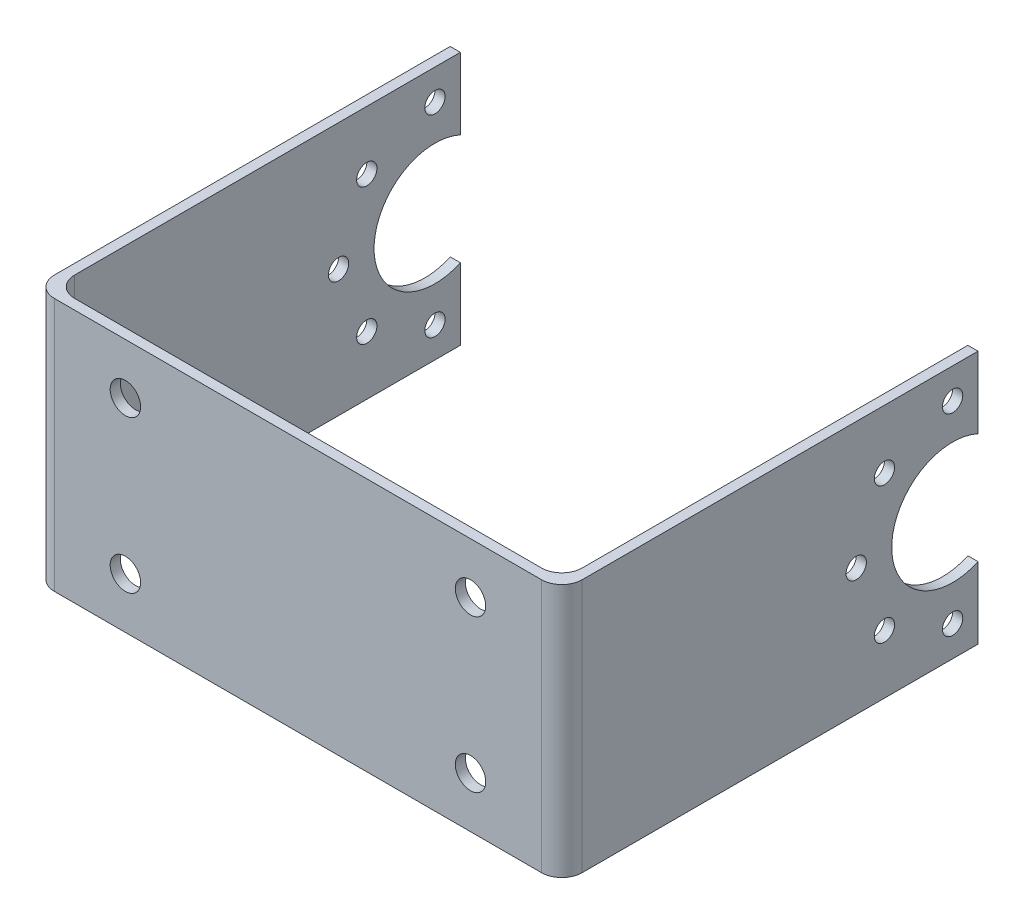
ISO-10303-21;
HEADER;
FILE_DESCRIPTION(('STEP AP214'),'2;1');
FILE_NAME('part.step','',(''),(''),'','','');
FILE_SCHEMA(('AUTOMOTIVE_DESIGN { 1 0 10303 214 1 1 1 1 }'));
ENDSEC;
DATA;
#1=APPLICATION_CONTEXT('core data for automotive mechanical design processes');
#2=APPLICATION_PROTOCOL_DEFINITION('international standard','automotive_design',2000,#1);
#3=PRODUCT_CONTEXT('',#1,'mechanical');
#4=PRODUCT('Part','Part','',(#3));
#5=PRODUCT_RELATED_PRODUCT_CATEGORY('part','',(#4));
#6=PRODUCT_DEFINITION_FORMATION('','',#4);
#7=PRODUCT_DEFINITION_CONTEXT('part definition',#1,'design');
#8=PRODUCT_DEFINITION('design','',#6,#7);
#9=PRODUCT_DEFINITION_SHAPE('','',#8);
#10=(LENGTH_UNIT() NAMED_UNIT(*) SI_UNIT(.MILLI.,.METRE.));
#11=(NAMED_UNIT(*) PLANE_ANGLE_UNIT() SI_UNIT($,.RADIAN.));
#12=(NAMED_UNIT(*) SI_UNIT($,.STERADIAN.) SOLID_ANGLE_UNIT());
#13=UNCERTAINTY_MEASURE_WITH_UNIT(LENGTH_MEASURE(1.E-05),#10,'distance_accuracy_value','');
#14=(GEOMETRIC_REPRESENTATION_CONTEXT(3) GLOBAL_UNCERTAINTY_ASSIGNED_CONTEXT((#13)) GLOBAL_UNIT_ASSIGNED_CONTEXT((#10,
#11,#12)) REPRESENTATION_CONTEXT('',''));
#15=CARTESIAN_POINT('',(0.,0.,0.));
#16=DIRECTION('',(0.,0.,1.));
#17=DIRECTION('',(1.,0.,0.));
#18=AXIS2_PLACEMENT_3D('',#15,#16,#17);
#19=CARTESIAN_POINT('',(29.5000000000001,25.,-40.5));
#20=DIRECTION('',(0.,0.,1.));
#21=DIRECTION('',(1.,0.,0.));
#22=AXIS2_PLACEMENT_3D('',#19,#20,#21);
#23=PLANE('',#22);
#24=DIRECTION('',(0.,-1.,0.));
#25=VECTOR('',#24,1.);
#26=CARTESIAN_POINT('',(28.5000000000001,25.,-40.5));
#27=LINE('',#26,#25);
#28=CARTESIAN_POINT('',(28.5000000000001,7.04564394268215,-40.5));
#29=VERTEX_POINT('',#28);
#30=CARTESIAN_POINT('',(28.5000000000001,0.,-40.5));
#31=VERTEX_POINT('',#30);
#32=EDGE_CURVE('E216',#29,#31,#27,.T.);
#33=ORIENTED_EDGE('',*,*,#32,.F.);
#34=DIRECTION('',(1.,0.,0.));
#35=VECTOR('',#34,1.);
#36=CARTESIAN_POINT('',(-22.4999999999999,7.04564394268215,-40.5));
#37=LINE('',#36,#35);
#38=CARTESIAN_POINT('',(29.5000000000001,7.04564394268215,-40.5));
#39=VERTEX_POINT('',#38);
#40=EDGE_CURVE('E200',#29,#39,#37,.T.);
#41=ORIENTED_EDGE('',*,*,#40,.T.);
#42=DIRECTION('',(0.,-1.,0.));
#43=VECTOR('',#42,1.);
#44=CARTESIAN_POINT('',(29.5000000000001,25.,-40.5));
#45=LINE('',#44,#43);
#46=CARTESIAN_POINT('',(29.5000000000001,0.,-40.5));
#47=VERTEX_POINT('',#46);
#48=EDGE_CURVE('E220',#39,#47,#45,.T.);
#49=ORIENTED_EDGE('',*,*,#48,.T.);
#50=DIRECTION('',(-1.,0.,0.));
#51=VECTOR('',#50,1.);
#52=CARTESIAN_POINT('',(29.5000000000001,0.,-40.5));
#53=LINE('',#52,#51);
#54=EDGE_CURVE('E272',#47,#31,#53,.T.);
#55=ORIENTED_EDGE('',*,*,#54,.T.);
#56=EDGE_LOOP('',(#33,#41,#49,#55));
#57=FACE_BOUND('',#56,.T.);
#58=ADVANCED_FACE('F65',(#57),#23,.F.);
#59=CARTESIAN_POINT('',(-22.4999999999999,25.,-40.5));
#60=DIRECTION('',(0.,0.,1.));
#61=DIRECTION('',(1.,0.,0.));
#62=AXIS2_PLACEMENT_3D('',#59,#60,#61);
#63=PLANE('',#62);
#64=DIRECTION('',(0.,-1.,0.));
#65=VECTOR('',#64,1.);
#66=CARTESIAN_POINT('',(-22.4999999999999,25.,-40.5));
#67=LINE('',#66,#65);
#68=CARTESIAN_POINT('',(-22.4999999999999,7.04564394268215,-40.5));
#69=VERTEX_POINT('',#68);
#70=CARTESIAN_POINT('',(-22.4999999999999,0.,-40.5));
#71=VERTEX_POINT('',#70);
#72=EDGE_CURVE('E207',#69,#71,#67,.T.);
#73=ORIENTED_EDGE('',*,*,#72,.F.);
#74=CARTESIAN_POINT('',(-21.4999999999999,7.04564394268215,-40.5));
#75=VERTEX_POINT('',#74);
#76=EDGE_CURVE('E184',#69,#75,#37,.T.);
#77=ORIENTED_EDGE('',*,*,#76,.T.);
#78=DIRECTION('',(0.,-1.,0.));
#79=VECTOR('',#78,1.);
#80=CARTESIAN_POINT('',(-21.4999999999999,25.,-40.5));
#81=LINE('',#80,#79);
#82=CARTESIAN_POINT('',(-21.4999999999999,0.,-40.5));
#83=VERTEX_POINT('',#82);
#84=EDGE_CURVE('E206',#75,#83,#81,.T.);
#85=ORIENTED_EDGE('',*,*,#84,.T.);
#86=DIRECTION('',(-1.,0.,0.));
#87=VECTOR('',#86,1.);
#88=CARTESIAN_POINT('',(-22.4999999999999,0.,-40.5));
#89=LINE('',#88,#87);
#90=EDGE_CURVE('E298',#83,#71,#89,.T.);
#91=ORIENTED_EDGE('',*,*,#90,.T.);
#92=EDGE_LOOP('',(#73,#77,#85,#91));
#93=FACE_BOUND('',#92,.T.);
#94=ADVANCED_FACE('F450',(#93),#63,.F.);
#95=CARTESIAN_POINT('',(29.5000000000001,25.,-0.500000000000002));
#96=DIRECTION('',(-1.,0.,0.));
#97=DIRECTION('',(0.,0.,1.));
#98=AXIS2_PLACEMENT_3D('',#95,#96,#97);
#99=PLANE('',#98);
#100=CARTESIAN_POINT('',(29.5000000000001,5.7824855787278,-31.2824855787278));
#101=DIRECTION('',(1.,0.,0.));
#102=DIRECTION('',(0.,0.,-1.));
#103=AXIS2_PLACEMENT_3D('',#100,#101,#102);
#104=CIRCLE('',#103,0.999999999999998);
#105=CARTESIAN_POINT('',(29.5000000000001,5.7824855787278,-32.2824855787278));
#106=VERTEX_POINT('',#105);
#107=EDGE_CURVE('E370',#106,#106,#104,.T.);
#108=ORIENTED_EDGE('',*,*,#107,.F.);
#109=EDGE_LOOP('',(#108));
#110=FACE_BOUND('',#109,.T.);
#111=CARTESIAN_POINT('',(29.5000000000001,3.,-38.));
#112=DIRECTION('',(1.,0.,0.));
#113=DIRECTION('',(0.,0.,-1.));
#114=AXIS2_PLACEMENT_3D('',#111,#112,#113);
#115=CIRCLE('',#114,0.999999999999998);
#116=CARTESIAN_POINT('',(29.5000000000001,3.,-39.));
#117=VERTEX_POINT('',#116);
#118=EDGE_CURVE('E358',#117,#117,#115,.T.);
#119=ORIENTED_EDGE('',*,*,#118,.F.);
#120=EDGE_LOOP('',(#119));
#121=FACE_BOUND('',#120,.T.);
#122=CARTESIAN_POINT('',(29.5000000000001,12.5,-28.5));
#123=DIRECTION('',(1.,0.,0.));
#124=DIRECTION('',(0.,0.,-1.));
#125=AXIS2_PLACEMENT_3D('',#122,#123,#124);
#126=CIRCLE('',#125,1.);
#127=CARTESIAN_POINT('',(29.5000000000001,12.5,-29.5));
#128=VERTEX_POINT('',#127);
#129=EDGE_CURVE('E346',#128,#128,#126,.T.);
#130=ORIENTED_EDGE('',*,*,#129,.F.);
#131=EDGE_LOOP('',(#130));
#132=FACE_BOUND('',#131,.T.);
#133=CARTESIAN_POINT('',(29.5000000000001,19.2175144212722,-31.2824855787278));
#134=DIRECTION('',(1.,0.,0.));
#135=DIRECTION('',(0.,0.,-1.));
#136=AXIS2_PLACEMENT_3D('',#133,#134,#135);
#137=CIRCLE('',#136,1.00000000000001);
#138=CARTESIAN_POINT('',(29.5000000000001,19.2175144212722,-32.2824855787278));
#139=VERTEX_POINT('',#138);
#140=EDGE_CURVE('E334',#139,#139,#137,.T.);
#141=ORIENTED_EDGE('',*,*,#140,.F.);
#142=EDGE_LOOP('',(#141));
#143=FACE_BOUND('',#142,.T.);
#144=CARTESIAN_POINT('',(29.5000000000001,22.,-38.));
#145=DIRECTION('',(1.,0.,0.));
#146=DIRECTION('',(0.,0.,-1.));
#147=AXIS2_PLACEMENT_3D('',#144,#145,#146);
#148=CIRCLE('',#147,0.999999999999998);
#149=CARTESIAN_POINT('',(29.5000000000001,22.,-39.));
#150=VERTEX_POINT('',#149);
#151=EDGE_CURVE('E322',#150,#150,#148,.T.);
#152=ORIENTED_EDGE('',*,*,#151,.F.);
#153=EDGE_LOOP('',(#152));
#154=FACE_BOUND('',#153,.T.);
#155=DIRECTION('',(0.,0.,-1.));
#156=VECTOR('',#155,1.);
#157=CARTESIAN_POINT('',(29.5000000000001,25.,-0.500000000000002));
#158=LINE('',#157,#156);
#159=CARTESIAN_POINT('',(29.5000000000001,25.,-1.5));
#160=VERTEX_POINT('',#159);
#161=CARTESIAN_POINT('',(29.5000000000001,25.,-40.5));
#162=VERTEX_POINT('',#161);
#163=EDGE_CURVE('E304',#160,#162,#158,.T.);
#164=ORIENTED_EDGE('',*,*,#163,.F.);
#165=DIRECTION('',(0.,-1.,0.));
#166=VECTOR('',#165,1.);
#167=CARTESIAN_POINT('',(29.5000000000001,25.,-1.5));
#168=LINE('',#167,#166);
#169=CARTESIAN_POINT('',(29.5000000000001,0.,-1.5));
#170=VERTEX_POINT('',#169);
#171=EDGE_CURVE('E246',#160,#170,#168,.T.);
#172=ORIENTED_EDGE('',*,*,#171,.T.);
#173=DIRECTION('',(0.,0.,-1.));
#174=VECTOR('',#173,1.);
#175=CARTESIAN_POINT('',(29.5000000000001,0.,-0.500000000000002));
#176=LINE('',#175,#174);
#177=EDGE_CURVE('E291',#170,#47,#176,.T.);
#178=ORIENTED_EDGE('',*,*,#177,.T.);
#179=ORIENTED_EDGE('',*,*,#48,.F.);
#180=CARTESIAN_POINT('',(29.5000000000001,12.5,-38.));
#181=DIRECTION('',(1.,0.,0.));
#182=DIRECTION('',(0.,0.,-1.));
#183=AXIS2_PLACEMENT_3D('',#180,#181,#182);
#184=CIRCLE('',#183,5.99999999999999);
#185=CARTESIAN_POINT('',(29.5000000000001,17.9543560573178,-40.5));
#186=VERTEX_POINT('',#185);
#187=EDGE_CURVE('E189',#186,#39,#184,.T.);
#188=ORIENTED_EDGE('',*,*,#187,.F.);
#189=EDGE_CURVE('E221',#162,#186,#45,.T.);
#190=ORIENTED_EDGE('',*,*,#189,.F.);
#191=EDGE_LOOP('',(#164,#172,#178,#179,#188,#190));
#192=FACE_BOUND('',#191,.T.);
#193=ADVANCED_FACE('F425',(#110,#121,#132,#143,#154,#192),#99,.F.);
#194=ORIENTED_EDGE('',*,*,#189,.T.);
#195=DIRECTION('',(1.,0.,0.));
#196=VECTOR('',#195,1.);
#197=CARTESIAN_POINT('',(-22.4999999999999,17.9543560573178,-40.5));
#198=LINE('',#197,#196);
#199=CARTESIAN_POINT('',(28.5,17.9543560573178,-40.5));
#200=VERTEX_POINT('',#199);
#201=EDGE_CURVE('E188',#200,#186,#198,.T.);
#202=ORIENTED_EDGE('',*,*,#201,.F.);
#203=CARTESIAN_POINT('',(28.5000000000001,25.,-40.5));
#204=VERTEX_POINT('',#203);
#205=EDGE_CURVE('E217',#204,#200,#27,.T.);
#206=ORIENTED_EDGE('',*,*,#205,.F.);
#207=DIRECTION('',(-1.,0.,0.));
#208=VECTOR('',#207,1.);
#209=CARTESIAN_POINT('',(29.5000000000001,25.,-40.5));
#210=LINE('',#209,#208);
#211=EDGE_CURVE('E283',#162,#204,#210,.T.);
#212=ORIENTED_EDGE('',*,*,#211,.F.);
#213=EDGE_LOOP('',(#194,#202,#206,#212));
#214=FACE_BOUND('',#213,.T.);
#215=ADVANCED_FACE('F433',(#214),#23,.F.);
#216=CARTESIAN_POINT('',(28.5000000000001,25.,-0.499999999999996));
#217=DIRECTION('',(1.,0.,0.));
#218=DIRECTION('',(0.,0.,-1.));
#219=AXIS2_PLACEMENT_3D('',#216,#217,#218);
#220=PLANE('',#219);
#221=CARTESIAN_POINT('',(28.5000000000001,5.7824855787278,-31.2824855787278));
#222=DIRECTION('',(1.,0.,0.));
#223=DIRECTION('',(0.,0.,-1.));
#224=AXIS2_PLACEMENT_3D('',#221,#222,#223);
#225=CIRCLE('',#224,0.999999999999998);
#226=CARTESIAN_POINT('',(28.5000000000001,5.7824855787278,-32.2824855787278));
#227=VERTEX_POINT('',#226);
#228=EDGE_CURVE('E362',#227,#227,#225,.T.);
#229=ORIENTED_EDGE('',*,*,#228,.T.);
#230=EDGE_LOOP('',(#229));
#231=FACE_BOUND('',#230,.T.);
#232=CARTESIAN_POINT('',(28.5000000000001,3.,-38.));
#233=DIRECTION('',(1.,0.,0.));
#234=DIRECTION('',(0.,0.,-1.));
#235=AXIS2_PLACEMENT_3D('',#232,#233,#234);
#236=CIRCLE('',#235,0.999999999999998);
#237=CARTESIAN_POINT('',(28.5000000000001,3.,-39.));
#238=VERTEX_POINT('',#237);
#239=EDGE_CURVE('E350',#238,#238,#236,.T.);
#240=ORIENTED_EDGE('',*,*,#239,.T.);
#241=EDGE_LOOP('',(#240));
#242=FACE_BOUND('',#241,.T.);
#243=CARTESIAN_POINT('',(28.5000000000001,12.5,-28.5));
#244=DIRECTION('',(1.,0.,0.));
#245=DIRECTION('',(0.,0.,-1.));
#246=AXIS2_PLACEMENT_3D('',#243,#244,#245);
#247=CIRCLE('',#246,1.);
#248=CARTESIAN_POINT('',(28.5000000000001,12.5,-29.5));
#249=VERTEX_POINT('',#248);
#250=EDGE_CURVE('E338',#249,#249,#247,.T.);
#251=ORIENTED_EDGE('',*,*,#250,.T.);
#252=EDGE_LOOP('',(#251));
#253=FACE_BOUND('',#252,.T.);
#254=CARTESIAN_POINT('',(28.5000000000001,19.2175144212722,-31.2824855787278));
#255=DIRECTION('',(1.,0.,0.));
#256=DIRECTION('',(0.,0.,-1.));
#257=AXIS2_PLACEMENT_3D('',#254,#255,#256);
#258=CIRCLE('',#257,1.00000000000001);
#259=CARTESIAN_POINT('',(28.5000000000001,19.2175144212722,-32.2824855787278));
#260=VERTEX_POINT('',#259);
#261=EDGE_CURVE('E326',#260,#260,#258,.T.);
#262=ORIENTED_EDGE('',*,*,#261,.T.);
#263=EDGE_LOOP('',(#262));
#264=FACE_BOUND('',#263,.T.);
#265=CARTESIAN_POINT('',(28.5000000000001,22.,-38.));
#266=DIRECTION('',(1.,0.,0.));
#267=DIRECTION('',(0.,0.,-1.));
#268=AXIS2_PLACEMENT_3D('',#265,#266,#267);
#269=CIRCLE('',#268,0.999999999999998);
#270=CARTESIAN_POINT('',(28.5000000000001,22.,-39.));
#271=VERTEX_POINT('',#270);
#272=EDGE_CURVE('E315',#271,#271,#269,.T.);
#273=ORIENTED_EDGE('',*,*,#272,.T.);
#274=EDGE_LOOP('',(#273));
#275=FACE_BOUND('',#274,.T.);
#276=DIRECTION('',(0.,0.,1.));
#277=VECTOR('',#276,1.);
#278=CARTESIAN_POINT('',(28.5000000000001,0.,-0.499999999999996));
#279=LINE('',#278,#277);
#280=CARTESIAN_POINT('',(28.5000000000001,0.,-2.5));
#281=VERTEX_POINT('',#280);
#282=EDGE_CURVE('E260',#31,#281,#279,.T.);
#283=ORIENTED_EDGE('',*,*,#282,.T.);
#284=DIRECTION('',(0.,-1.,0.));
#285=VECTOR('',#284,1.);
#286=CARTESIAN_POINT('',(28.5000000000001,25.,-2.5));
#287=LINE('',#286,#285);
#288=CARTESIAN_POINT('',(28.5000000000001,25.,-2.5));
#289=VERTEX_POINT('',#288);
#290=EDGE_CURVE('E249',#281,#289,#287,.F.);
#291=ORIENTED_EDGE('',*,*,#290,.T.);
#292=DIRECTION('',(0.,0.,1.));
#293=VECTOR('',#292,1.);
#294=CARTESIAN_POINT('',(28.5000000000001,25.,-0.499999999999996));
#295=LINE('',#294,#293);
#296=EDGE_CURVE('E277',#204,#289,#295,.T.);
#297=ORIENTED_EDGE('',*,*,#296,.F.);
#298=ORIENTED_EDGE('',*,*,#205,.T.);
#299=CARTESIAN_POINT('',(28.5000000000001,12.5,-38.));
#300=DIRECTION('',(1.,0.,0.));
#301=DIRECTION('',(0.,0.,-1.));
#302=AXIS2_PLACEMENT_3D('',#299,#300,#301);
#303=CIRCLE('',#302,5.99999999999999);
#304=EDGE_CURVE('E293',#200,#29,#303,.T.);
#305=ORIENTED_EDGE('',*,*,#304,.T.);
#306=ORIENTED_EDGE('',*,*,#32,.T.);
#307=EDGE_LOOP('',(#283,#291,#297,#298,#305,#306));
#308=FACE_BOUND('',#307,.T.);
#309=ADVANCED_FACE('F266',(#231,#242,#253,#264,#275,#308),#220,.F.);
#310=CARTESIAN_POINT('',(-21.4999999999999,25.,-0.499999999999996));
#311=DIRECTION('',(0.,0.,1.));
#312=DIRECTION('',(1.,0.,0.));
#313=AXIS2_PLACEMENT_3D('',#310,#311,#312);
#314=PLANE('',#313);
#315=CARTESIAN_POINT('',(20.5000000000001,5.,-0.499999999999994));
#316=DIRECTION('',(0.,0.,1.));
#317=DIRECTION('',(1.,0.,0.));
#318=AXIS2_PLACEMENT_3D('',#315,#316,#317);
#319=CIRCLE('',#318,1.5);
#320=CARTESIAN_POINT('',(22.0000000000001,5.,-0.499999999999994));
#321=VERTEX_POINT('',#320);
#322=EDGE_CURVE('E394',#321,#321,#319,.T.);
#323=ORIENTED_EDGE('',*,*,#322,.T.);
#324=EDGE_LOOP('',(#323));
#325=FACE_BOUND('',#324,.T.);
#326=CARTESIAN_POINT('',(20.5,20.,-0.499999999999994));
#327=DIRECTION('',(0.,0.,1.));
#328=DIRECTION('',(1.,0.,0.));
#329=AXIS2_PLACEMENT_3D('',#326,#327,#328);
#330=CIRCLE('',#329,1.5);
#331=CARTESIAN_POINT('',(22.,20.,-0.499999999999994));
#332=VERTEX_POINT('',#331);
#333=EDGE_CURVE('E388',#332,#332,#330,.T.);
#334=ORIENTED_EDGE('',*,*,#333,.T.);
#335=EDGE_LOOP('',(#334));
#336=FACE_BOUND('',#335,.T.);
#337=CARTESIAN_POINT('',(-13.5,5.,-0.499999999999994));
#338=DIRECTION('',(0.,0.,1.));
#339=DIRECTION('',(1.,0.,0.));
#340=AXIS2_PLACEMENT_3D('',#337,#338,#339);
#341=CIRCLE('',#340,1.5);
#342=CARTESIAN_POINT('',(-11.9999999999999,5.,-0.499999999999994));
#343=VERTEX_POINT('',#342);
#344=EDGE_CURVE('E382',#343,#343,#341,.T.);
#345=ORIENTED_EDGE('',*,*,#344,.T.);
#346=EDGE_LOOP('',(#345));
#347=FACE_BOUND('',#346,.T.);
#348=CARTESIAN_POINT('',(-13.5,20.,-0.499999999999994));
#349=DIRECTION('',(0.,0.,1.));
#350=DIRECTION('',(1.,0.,0.));
#351=AXIS2_PLACEMENT_3D('',#348,#349,#350);
#352=CIRCLE('',#351,1.5);
#353=CARTESIAN_POINT('',(-12.,20.,-0.499999999999994));
#354=VERTEX_POINT('',#353);
#355=EDGE_CURVE('E374',#354,#354,#352,.T.);
#356=ORIENTED_EDGE('',*,*,#355,.T.);
#357=EDGE_LOOP('',(#356));
#358=FACE_BOUND('',#357,.T.);
#359=DIRECTION('',(-1.,0.,0.));
#360=VECTOR('',#359,1.);
#361=CARTESIAN_POINT('',(-21.4999999999999,0.,-0.499999999999996));
#362=LINE('',#361,#360);
#363=CARTESIAN_POINT('',(26.5,0.,-0.499999999999996));
#364=VERTEX_POINT('',#363);
#365=CARTESIAN_POINT('',(-19.4999999999999,0.,-0.499999999999996));
#366=VERTEX_POINT('',#365);
#367=EDGE_CURVE('E261',#364,#366,#362,.T.);
#368=ORIENTED_EDGE('',*,*,#367,.T.);
#369=DIRECTION('',(0.,-1.,0.));
#370=VECTOR('',#369,1.);
#371=CARTESIAN_POINT('',(-19.4999999999999,25.,-0.499999999999996));
#372=LINE('',#371,#370);
#373=CARTESIAN_POINT('',(-19.4999999999999,25.,-0.499999999999996));
#374=VERTEX_POINT('',#373);
#375=EDGE_CURVE('E88',#366,#374,#372,.F.);
#376=ORIENTED_EDGE('',*,*,#375,.T.);
#377=DIRECTION('',(-1.,0.,0.));
#378=VECTOR('',#377,1.);
#379=CARTESIAN_POINT('',(-21.4999999999999,25.,-0.499999999999996));
#380=LINE('',#379,#378);
#381=CARTESIAN_POINT('',(26.5,25.,-0.499999999999996));
#382=VERTEX_POINT('',#381);
#383=EDGE_CURVE('E276',#382,#374,#380,.T.);
#384=ORIENTED_EDGE('',*,*,#383,.F.);
#385=DIRECTION('',(0.,-1.,0.));
#386=VECTOR('',#385,1.);
#387=CARTESIAN_POINT('',(26.5,0.,-0.499999999999996));
#388=LINE('',#387,#386);
#389=EDGE_CURVE('E242',#382,#364,#388,.T.);
#390=ORIENTED_EDGE('',*,*,#389,.T.);
#391=EDGE_LOOP('',(#368,#376,#384,#390));
#392=FACE_BOUND('',#391,.T.);
#393=ADVANCED_FACE('F278',(#325,#336,#347,#358,#392),#314,.F.);
#394=CARTESIAN_POINT('',(-21.4999999999999,25.,-0.499999999999996));
#395=DIRECTION('',(-1.,0.,0.));
#396=DIRECTION('',(0.,0.,1.));
#397=AXIS2_PLACEMENT_3D('',#394,#395,#396);
#398=PLANE('',#397);
#399=CARTESIAN_POINT('',(-21.4999999999999,5.7824855787278,-31.2824855787278));
#400=DIRECTION('',(-1.,0.,0.));
#401=DIRECTION('',(0.,0.,1.));
#402=AXIS2_PLACEMENT_3D('',#399,#400,#401);
#403=CIRCLE('',#402,0.999999999999998);
#404=CARTESIAN_POINT('',(-21.4999999999999,5.7824855787278,-30.2824855787278));
#405=VERTEX_POINT('',#404);
#406=EDGE_CURVE('E367',#405,#405,#403,.T.);
#407=ORIENTED_EDGE('',*,*,#406,.T.);
#408=EDGE_LOOP('',(#407));
#409=FACE_BOUND('',#408,.T.);
#410=CARTESIAN_POINT('',(-21.4999999999999,3.,-38.));
#411=DIRECTION('',(-1.,0.,0.));
#412=DIRECTION('',(0.,0.,1.));
#413=AXIS2_PLACEMENT_3D('',#410,#411,#412);
#414=CIRCLE('',#413,0.999999999999998);
#415=CARTESIAN_POINT('',(-21.4999999999999,3.,-37.));
#416=VERTEX_POINT('',#415);
#417=EDGE_CURVE('E355',#416,#416,#414,.T.);
#418=ORIENTED_EDGE('',*,*,#417,.T.);
#419=EDGE_LOOP('',(#418));
#420=FACE_BOUND('',#419,.T.);
#421=CARTESIAN_POINT('',(-21.4999999999999,12.5,-28.5));
#422=DIRECTION('',(-1.,0.,0.));
#423=DIRECTION('',(0.,0.,1.));
#424=AXIS2_PLACEMENT_3D('',#421,#422,#423);
#425=CIRCLE('',#424,1.);
#426=CARTESIAN_POINT('',(-21.4999999999999,12.5,-27.5));
#427=VERTEX_POINT('',#426);
#428=EDGE_CURVE('E343',#427,#427,#425,.T.);
#429=ORIENTED_EDGE('',*,*,#428,.T.);
#430=EDGE_LOOP('',(#429));
#431=FACE_BOUND('',#430,.T.);
#432=CARTESIAN_POINT('',(-21.4999999999999,19.2175144212722,-31.2824855787278));
#433=DIRECTION('',(-1.,0.,0.));
#434=DIRECTION('',(0.,0.,1.));
#435=AXIS2_PLACEMENT_3D('',#432,#433,#434);
#436=CIRCLE('',#435,1.00000000000001);
#437=CARTESIAN_POINT('',(-21.4999999999999,19.2175144212722,-30.2824855787278));
#438=VERTEX_POINT('',#437);
#439=EDGE_CURVE('E331',#438,#438,#436,.T.);
#440=ORIENTED_EDGE('',*,*,#439,.T.);
#441=EDGE_LOOP('',(#440));
#442=FACE_BOUND('',#441,.T.);
#443=CARTESIAN_POINT('',(-21.4999999999999,22.,-38.));
#444=DIRECTION('',(-1.,0.,0.));
#445=DIRECTION('',(0.,0.,1.));
#446=AXIS2_PLACEMENT_3D('',#443,#444,#445);
#447=CIRCLE('',#446,0.999999999999998);
#448=CARTESIAN_POINT('',(-21.4999999999999,22.,-37.));
#449=VERTEX_POINT('',#448);
#450=EDGE_CURVE('E319',#449,#449,#447,.T.);
#451=ORIENTED_EDGE('',*,*,#450,.T.);
#452=EDGE_LOOP('',(#451));
#453=FACE_BOUND('',#452,.T.);
#454=DIRECTION('',(0.,0.,-1.));
#455=VECTOR('',#454,1.);
#456=CARTESIAN_POINT('',(-21.4999999999999,25.,-0.499999999999996));
#457=LINE('',#456,#455);
#458=CARTESIAN_POINT('',(-21.4999999999999,25.,-2.5));
#459=VERTEX_POINT('',#458);
#460=CARTESIAN_POINT('',(-21.4999999999999,25.,-40.5));
#461=VERTEX_POINT('',#460);
#462=EDGE_CURVE('E279',#459,#461,#457,.T.);
#463=ORIENTED_EDGE('',*,*,#462,.F.);
#464=DIRECTION('',(0.,-1.,0.));
#465=VECTOR('',#464,1.);
#466=CARTESIAN_POINT('',(-21.4999999999999,0.,-2.5));
#467=LINE('',#466,#465);
#468=CARTESIAN_POINT('',(-21.4999999999999,0.,-2.5));
#469=VERTEX_POINT('',#468);
#470=EDGE_CURVE('E239',#459,#469,#467,.T.);
#471=ORIENTED_EDGE('',*,*,#470,.T.);
#472=DIRECTION('',(0.,0.,-1.));
#473=VECTOR('',#472,1.);
#474=CARTESIAN_POINT('',(-21.4999999999999,0.,-0.499999999999996));
#475=LINE('',#474,#473);
#476=EDGE_CURVE('E296',#469,#83,#475,.T.);
#477=ORIENTED_EDGE('',*,*,#476,.T.);
#478=ORIENTED_EDGE('',*,*,#84,.F.);
#479=CARTESIAN_POINT('',(-21.4999999999999,12.5,-38.));
#480=DIRECTION('',(-1.,0.,0.));
#481=DIRECTION('',(0.,0.,1.));
#482=AXIS2_PLACEMENT_3D('',#479,#480,#481);
#483=CIRCLE('',#482,5.99999999999999);
#484=CARTESIAN_POINT('',(-21.4999999999999,17.9543560573178,-40.5));
#485=VERTEX_POINT('',#484);
#486=EDGE_CURVE('E312',#75,#485,#483,.T.);
#487=ORIENTED_EDGE('',*,*,#486,.T.);
#488=EDGE_CURVE('E199',#461,#485,#81,.T.);
#489=ORIENTED_EDGE('',*,*,#488,.F.);
#490=EDGE_LOOP('',(#463,#471,#477,#478,#487,#489));
#491=FACE_BOUND('',#490,.T.);
#492=ADVANCED_FACE('F532',(#409,#420,#431,#442,#453,#491),#398,.F.);
#493=ORIENTED_EDGE('',*,*,#488,.T.);
#494=CARTESIAN_POINT('',(-22.4999999999999,17.9543560573178,-40.5));
#495=VERTEX_POINT('',#494);
#496=EDGE_CURVE('E181',#495,#485,#198,.T.);
#497=ORIENTED_EDGE('',*,*,#496,.F.);
#498=CARTESIAN_POINT('',(-22.4999999999999,25.,-40.5));
#499=VERTEX_POINT('',#498);
#500=EDGE_CURVE('E196',#499,#495,#67,.T.);
#501=ORIENTED_EDGE('',*,*,#500,.F.);
#502=DIRECTION('',(-1.,0.,0.));
#503=VECTOR('',#502,1.);
#504=CARTESIAN_POINT('',(-22.4999999999999,25.,-40.5));
#505=LINE('',#504,#503);
#506=EDGE_CURVE('E281',#461,#499,#505,.T.);
#507=ORIENTED_EDGE('',*,*,#506,.F.);
#508=EDGE_LOOP('',(#493,#497,#501,#507));
#509=FACE_BOUND('',#508,.T.);
#510=ADVANCED_FACE('F194',(#509),#63,.F.);
#511=CARTESIAN_POINT('',(-22.4999999999999,25.,-0.499999999999996));
#512=DIRECTION('',(1.,0.,0.));
#513=DIRECTION('',(0.,0.,-1.));
#514=AXIS2_PLACEMENT_3D('',#511,#512,#513);
#515=PLANE('',#514);
#516=CARTESIAN_POINT('',(-22.4999999999999,5.7824855787278,-31.2824855787278));
#517=DIRECTION('',(1.,0.,0.));
#518=DIRECTION('',(0.,0.,-1.));
#519=AXIS2_PLACEMENT_3D('',#516,#517,#518);
#520=CIRCLE('',#519,0.999999999999998);
#521=CARTESIAN_POINT('',(-22.4999999999999,5.7824855787278,-32.2824855787278));
#522=VERTEX_POINT('',#521);
#523=EDGE_CURVE('E371',#522,#522,#520,.T.);
#524=ORIENTED_EDGE('',*,*,#523,.T.);
#525=EDGE_LOOP('',(#524));
#526=FACE_BOUND('',#525,.T.);
#527=CARTESIAN_POINT('',(-22.4999999999999,3.,-38.));
#528=DIRECTION('',(1.,0.,0.));
#529=DIRECTION('',(0.,0.,-1.));
#530=AXIS2_PLACEMENT_3D('',#527,#528,#529);
#531=CIRCLE('',#530,0.999999999999998);
#532=CARTESIAN_POINT('',(-22.4999999999999,3.,-39.));
#533=VERTEX_POINT('',#532);
#534=EDGE_CURVE('E359',#533,#533,#531,.T.);
#535=ORIENTED_EDGE('',*,*,#534,.T.);
#536=EDGE_LOOP('',(#535));
#537=FACE_BOUND('',#536,.T.);
#538=CARTESIAN_POINT('',(-22.4999999999999,12.5,-28.5));
#539=DIRECTION('',(1.,0.,0.));
#540=DIRECTION('',(0.,0.,-1.));
#541=AXIS2_PLACEMENT_3D('',#538,#539,#540);
#542=CIRCLE('',#541,1.);
#543=CARTESIAN_POINT('',(-22.4999999999999,12.5,-29.5));
#544=VERTEX_POINT('',#543);
#545=EDGE_CURVE('E347',#544,#544,#542,.T.);
#546=ORIENTED_EDGE('',*,*,#545,.T.);
#547=EDGE_LOOP('',(#546));
#548=FACE_BOUND('',#547,.T.);
#549=CARTESIAN_POINT('',(-22.4999999999999,19.2175144212722,-31.2824855787278));
#550=DIRECTION('',(1.,0.,0.));
#551=DIRECTION('',(0.,0.,-1.));
#552=AXIS2_PLACEMENT_3D('',#549,#550,#551);
#553=CIRCLE('',#552,1.00000000000001);
#554=CARTESIAN_POINT('',(-22.4999999999999,19.2175144212722,-32.2824855787278));
#555=VERTEX_POINT('',#554);
#556=EDGE_CURVE('E335',#555,#555,#553,.T.);
#557=ORIENTED_EDGE('',*,*,#556,.T.);
#558=EDGE_LOOP('',(#557));
#559=FACE_BOUND('',#558,.T.);
#560=CARTESIAN_POINT('',(-22.4999999999999,22.,-38.));
#561=DIRECTION('',(1.,0.,0.));
#562=DIRECTION('',(0.,0.,-1.));
#563=AXIS2_PLACEMENT_3D('',#560,#561,#562);
#564=CIRCLE('',#563,0.999999999999998);
#565=CARTESIAN_POINT('',(-22.4999999999999,22.,-39.));
#566=VERTEX_POINT('',#565);
#567=EDGE_CURVE('E323',#566,#566,#564,.T.);
#568=ORIENTED_EDGE('',*,*,#567,.T.);
#569=EDGE_LOOP('',(#568));
#570=FACE_BOUND('',#569,.T.);
#571=DIRECTION('',(0.,0.,1.));
#572=VECTOR('',#571,1.);
#573=CARTESIAN_POINT('',(-22.4999999999999,0.,-0.499999999999996));
#574=LINE('',#573,#572);
#575=CARTESIAN_POINT('',(-22.4999999999999,0.,-1.5));
#576=VERTEX_POINT('',#575);
#577=EDGE_CURVE('E300',#71,#576,#574,.T.);
#578=ORIENTED_EDGE('',*,*,#577,.T.);
#579=DIRECTION('',(0.,-1.,0.));
#580=VECTOR('',#579,1.);
#581=CARTESIAN_POINT('',(-22.4999999999999,25.,-1.5));
#582=LINE('',#581,#580);
#583=CARTESIAN_POINT('',(-22.4999999999999,25.,-1.5));
#584=VERTEX_POINT('',#583);
#585=EDGE_CURVE('E233',#576,#584,#582,.F.);
#586=ORIENTED_EDGE('',*,*,#585,.T.);
#587=DIRECTION('',(0.,0.,1.));
#588=VECTOR('',#587,1.);
#589=CARTESIAN_POINT('',(-22.4999999999999,25.,-0.499999999999996));
#590=LINE('',#589,#588);
#591=EDGE_CURVE('E205',#499,#584,#590,.T.);
#592=ORIENTED_EDGE('',*,*,#591,.F.);
#593=ORIENTED_EDGE('',*,*,#500,.T.);
#594=CARTESIAN_POINT('',(-22.4999999999999,12.5,-38.));
#595=DIRECTION('',(1.,0.,0.));
#596=DIRECTION('',(0.,0.,-1.));
#597=AXIS2_PLACEMENT_3D('',#594,#595,#596);
#598=CIRCLE('',#597,5.99999999999999);
#599=EDGE_CURVE('E178',#495,#69,#598,.T.);
#600=ORIENTED_EDGE('',*,*,#599,.T.);
#601=ORIENTED_EDGE('',*,*,#72,.T.);
#602=EDGE_LOOP('',(#578,#586,#592,#593,#600,#601));
#603=FACE_BOUND('',#602,.T.);
#604=ADVANCED_FACE('F203',(#526,#537,#548,#559,#570,#603),#515,.F.);
#605=CARTESIAN_POINT('',(-22.4999999999999,25.,0.499999999999999));
#606=DIRECTION('',(0.,0.,-1.));
#607=DIRECTION('',(-1.,0.,0.));
#608=AXIS2_PLACEMENT_3D('',#605,#606,#607);
#609=PLANE('',#608);
#610=CARTESIAN_POINT('',(20.5000000000001,5.,0.499999999999998));
#611=DIRECTION('',(0.,0.,1.));
#612=DIRECTION('',(1.,0.,0.));
#613=AXIS2_PLACEMENT_3D('',#610,#611,#612);
#614=CIRCLE('',#613,1.5);
#615=CARTESIAN_POINT('',(22.0000000000001,5.,0.499999999999998));
#616=VERTEX_POINT('',#615);
#617=EDGE_CURVE('E397',#616,#616,#614,.T.);
#618=ORIENTED_EDGE('',*,*,#617,.F.);
#619=EDGE_LOOP('',(#618));
#620=FACE_BOUND('',#619,.T.);
#621=CARTESIAN_POINT('',(20.5,20.,0.499999999999998));
#622=DIRECTION('',(0.,0.,1.));
#623=DIRECTION('',(1.,0.,0.));
#624=AXIS2_PLACEMENT_3D('',#621,#622,#623);
#625=CIRCLE('',#624,1.5);
#626=CARTESIAN_POINT('',(22.,20.,0.499999999999998));
#627=VERTEX_POINT('',#626);
#628=EDGE_CURVE('E391',#627,#627,#625,.T.);
#629=ORIENTED_EDGE('',*,*,#628,.F.);
#630=EDGE_LOOP('',(#629));
#631=FACE_BOUND('',#630,.T.);
#632=CARTESIAN_POINT('',(-13.5,5.,0.499999999999998));
#633=DIRECTION('',(0.,0.,1.));
#634=DIRECTION('',(1.,0.,0.));
#635=AXIS2_PLACEMENT_3D('',#632,#633,#634);
#636=CIRCLE('',#635,1.5);
#637=CARTESIAN_POINT('',(-11.9999999999999,5.,0.499999999999998));
#638=VERTEX_POINT('',#637);
#639=EDGE_CURVE('E385',#638,#638,#636,.T.);
#640=ORIENTED_EDGE('',*,*,#639,.F.);
#641=EDGE_LOOP('',(#640));
#642=FACE_BOUND('',#641,.T.);
#643=CARTESIAN_POINT('',(-13.5,20.,0.499999999999998));
#644=DIRECTION('',(0.,0.,1.));
#645=DIRECTION('',(1.,0.,0.));
#646=AXIS2_PLACEMENT_3D('',#643,#644,#645);
#647=CIRCLE('',#646,1.5);
#648=CARTESIAN_POINT('',(-12.,20.,0.499999999999998));
#649=VERTEX_POINT('',#648);
#650=EDGE_CURVE('E379',#649,#649,#647,.T.);
#651=ORIENTED_EDGE('',*,*,#650,.F.);
#652=EDGE_LOOP('',(#651));
#653=FACE_BOUND('',#652,.T.);
#654=DIRECTION('',(1.,0.,0.));
#655=VECTOR('',#654,1.);
#656=CARTESIAN_POINT('',(-22.4999999999999,25.,0.499999999999999));
#657=LINE('',#656,#655);
#658=CARTESIAN_POINT('',(-20.4999999999999,25.,0.499999999999999));
#659=VERTEX_POINT('',#658);
#660=CARTESIAN_POINT('',(27.5,25.,0.499999999999998));
#661=VERTEX_POINT('',#660);
#662=EDGE_CURVE('E211',#659,#661,#657,.T.);
#663=ORIENTED_EDGE('',*,*,#662,.F.);
#664=DIRECTION('',(0.,-1.,0.));
#665=VECTOR('',#664,1.);
#666=CARTESIAN_POINT('',(-20.4999999999999,25.,0.499999999999999));
#667=LINE('',#666,#665);
#668=CARTESIAN_POINT('',(-20.4999999999999,0.,0.499999999999999));
#669=VERTEX_POINT('',#668);
#670=EDGE_CURVE('E226',#659,#669,#667,.T.);
#671=ORIENTED_EDGE('',*,*,#670,.T.);
#672=DIRECTION('',(1.,0.,0.));
#673=VECTOR('',#672,1.);
#674=CARTESIAN_POINT('',(-22.4999999999999,0.,0.499999999999999));
#675=LINE('',#674,#673);
#676=CARTESIAN_POINT('',(27.5,0.,0.499999999999998));
#677=VERTEX_POINT('',#676);
#678=EDGE_CURVE('E213',#669,#677,#675,.T.);
#679=ORIENTED_EDGE('',*,*,#678,.T.);
#680=DIRECTION('',(0.,-1.,0.));
#681=VECTOR('',#680,1.);
#682=CARTESIAN_POINT('',(27.5000000000001,25.,0.499999999999998));
#683=LINE('',#682,#681);
#684=EDGE_CURVE('E224',#677,#661,#683,.F.);
#685=ORIENTED_EDGE('',*,*,#684,.T.);
#686=EDGE_LOOP('',(#663,#671,#679,#685));
#687=FACE_BOUND('',#686,.T.);
#688=ADVANCED_FACE('F404',(#620,#631,#642,#653,#687),#609,.F.);
#689=CARTESIAN_POINT('',(0.,25.,0.));
#690=DIRECTION('',(0.,1.,0.));
#691=DIRECTION('',(0.,0.,1.));
#692=AXIS2_PLACEMENT_3D('',#689,#690,#691);
#693=PLANE('',#692);
#694=ORIENTED_EDGE('',*,*,#591,.T.);
#695=CARTESIAN_POINT('',(-20.4999999999999,25.,-1.5));
#696=DIRECTION('',(0.,1.,0.));
#697=DIRECTION('',(0.,0.,1.));
#698=AXIS2_PLACEMENT_3D('',#695,#696,#697);
#699=CIRCLE('',#698,2.);
#700=EDGE_CURVE('E237',#584,#659,#699,.T.);
#701=ORIENTED_EDGE('',*,*,#700,.T.);
#702=ORIENTED_EDGE('',*,*,#662,.T.);
#703=CARTESIAN_POINT('',(27.5000000000001,25.,-1.5));
#704=DIRECTION('',(0.,1.,0.));
#705=DIRECTION('',(0.,0.,1.));
#706=AXIS2_PLACEMENT_3D('',#703,#704,#705);
#707=CIRCLE('',#706,2.);
#708=EDGE_CURVE('E235',#661,#160,#707,.T.);
#709=ORIENTED_EDGE('',*,*,#708,.T.);
#710=ORIENTED_EDGE('',*,*,#163,.T.);
#711=ORIENTED_EDGE('',*,*,#211,.T.);
#712=ORIENTED_EDGE('',*,*,#296,.T.);
#713=CARTESIAN_POINT('',(26.5,25.,-2.5));
#714=DIRECTION('',(0.,1.,0.));
#715=DIRECTION('',(0.,0.,1.));
#716=AXIS2_PLACEMENT_3D('',#713,#714,#715);
#717=CIRCLE('',#716,2.);
#718=EDGE_CURVE('E12',#289,#382,#717,.F.);
#719=ORIENTED_EDGE('',*,*,#718,.T.);
#720=ORIENTED_EDGE('',*,*,#383,.T.);
#721=CARTESIAN_POINT('',(-19.4999999999999,25.,-2.5));
#722=DIRECTION('',(0.,1.,0.));
#723=DIRECTION('',(0.,0.,1.));
#724=AXIS2_PLACEMENT_3D('',#721,#722,#723);
#725=CIRCLE('',#724,2.);
#726=EDGE_CURVE('E80',#374,#459,#725,.F.);
#727=ORIENTED_EDGE('',*,*,#726,.T.);
#728=ORIENTED_EDGE('',*,*,#462,.T.);
#729=ORIENTED_EDGE('',*,*,#506,.T.);
#730=EDGE_LOOP('',(#694,#701,#702,#709,#710,#711,#712,#719,#720,#727,#728,#729));
#731=FACE_BOUND('',#730,.T.);
#732=ADVANCED_FACE('F275',(#731),#693,.T.);
#733=CARTESIAN_POINT('',(0.,0.,0.));
#734=DIRECTION('',(0.,1.,0.));
#735=DIRECTION('',(0.,0.,1.));
#736=AXIS2_PLACEMENT_3D('',#733,#734,#735);
#737=PLANE('',#736);
#738=ORIENTED_EDGE('',*,*,#678,.F.);
#739=CARTESIAN_POINT('',(-20.4999999999999,0.,-1.5));
#740=DIRECTION('',(0.,1.,0.));
#741=DIRECTION('',(0.,0.,1.));
#742=AXIS2_PLACEMENT_3D('',#739,#740,#741);
#743=CIRCLE('',#742,2.);
#744=EDGE_CURVE('E231',#669,#576,#743,.F.);
#745=ORIENTED_EDGE('',*,*,#744,.T.);
#746=ORIENTED_EDGE('',*,*,#577,.F.);
#747=ORIENTED_EDGE('',*,*,#90,.F.);
#748=ORIENTED_EDGE('',*,*,#476,.F.);
#749=CARTESIAN_POINT('',(-19.4999999999999,0.,-2.5));
#750=DIRECTION('',(0.,1.,0.));
#751=DIRECTION('',(0.,0.,1.));
#752=AXIS2_PLACEMENT_3D('',#749,#750,#751);
#753=CIRCLE('',#752,2.);
#754=EDGE_CURVE('E251',#469,#366,#753,.T.);
#755=ORIENTED_EDGE('',*,*,#754,.T.);
#756=ORIENTED_EDGE('',*,*,#367,.F.);
#757=CARTESIAN_POINT('',(26.5,0.,-2.5));
#758=DIRECTION('',(0.,1.,0.));
#759=DIRECTION('',(0.,0.,1.));
#760=AXIS2_PLACEMENT_3D('',#757,#758,#759);
#761=CIRCLE('',#760,2.);
#762=EDGE_CURVE('E73',#364,#281,#761,.T.);
#763=ORIENTED_EDGE('',*,*,#762,.T.);
#764=ORIENTED_EDGE('',*,*,#282,.F.);
#765=ORIENTED_EDGE('',*,*,#54,.F.);
#766=ORIENTED_EDGE('',*,*,#177,.F.);
#767=CARTESIAN_POINT('',(27.5000000000001,0.,-1.5));
#768=DIRECTION('',(0.,1.,0.));
#769=DIRECTION('',(0.,0.,1.));
#770=AXIS2_PLACEMENT_3D('',#767,#768,#769);
#771=CIRCLE('',#770,2.);
#772=EDGE_CURVE('E229',#170,#677,#771,.F.);
#773=ORIENTED_EDGE('',*,*,#772,.T.);
#774=EDGE_LOOP('',(#738,#745,#746,#747,#748,#755,#756,#763,#764,#765,#766,#773));
#775=FACE_BOUND('',#774,.T.);
#776=ADVANCED_FACE('F258',(#775),#737,.F.);
#777=CARTESIAN_POINT('',(-22.4999999999999,12.5,-38.));
#778=DIRECTION('',(1.,0.,0.));
#779=DIRECTION('',(0.,0.,-1.));
#780=AXIS2_PLACEMENT_3D('',#777,#778,#779);
#781=CYLINDRICAL_SURFACE('',#780,5.99999999999999);
#782=ORIENTED_EDGE('',*,*,#76,.F.);
#783=ORIENTED_EDGE('',*,*,#599,.F.);
#784=ORIENTED_EDGE('',*,*,#496,.T.);
#785=ORIENTED_EDGE('',*,*,#486,.F.);
#786=EDGE_LOOP('',(#782,#783,#784,#785));
#787=FACE_BOUND('',#786,.T.);
#788=ADVANCED_FACE('F180',(#787),#781,.F.);
#789=ORIENTED_EDGE('',*,*,#201,.T.);
#790=ORIENTED_EDGE('',*,*,#187,.T.);
#791=ORIENTED_EDGE('',*,*,#40,.F.);
#792=ORIENTED_EDGE('',*,*,#304,.F.);
#793=EDGE_LOOP('',(#789,#790,#791,#792));
#794=FACE_BOUND('',#793,.T.);
#795=ADVANCED_FACE('F437',(#794),#781,.F.);
#796=CARTESIAN_POINT('',(-22.4999999999999,22.,-38.));
#797=DIRECTION('',(1.,0.,0.));
#798=DIRECTION('',(0.,0.,-1.));
#799=AXIS2_PLACEMENT_3D('',#796,#797,#798);
#800=CYLINDRICAL_SURFACE('',#799,0.999999999999998);
#801=ORIENTED_EDGE('',*,*,#567,.F.);
#802=EDGE_LOOP('',(#801));
#803=FACE_BOUND('',#802,.T.);
#804=ORIENTED_EDGE('',*,*,#450,.F.);
#805=EDGE_LOOP('',(#804));
#806=FACE_BOUND('',#805,.T.);
#807=ADVANCED_FACE('F439',(#803,#806),#800,.F.);
#808=ORIENTED_EDGE('',*,*,#151,.T.);
#809=EDGE_LOOP('',(#808));
#810=FACE_BOUND('',#809,.T.);
#811=ORIENTED_EDGE('',*,*,#272,.F.);
#812=EDGE_LOOP('',(#811));
#813=FACE_BOUND('',#812,.T.);
#814=ADVANCED_FACE('F445',(#810,#813),#800,.F.);
#815=CARTESIAN_POINT('',(-22.4999999999999,19.2175144212722,-31.2824855787278));
#816=DIRECTION('',(1.,0.,0.));
#817=DIRECTION('',(0.,0.,-1.));
#818=AXIS2_PLACEMENT_3D('',#815,#816,#817);
#819=CYLINDRICAL_SURFACE('',#818,1.00000000000001);
#820=ORIENTED_EDGE('',*,*,#556,.F.);
#821=EDGE_LOOP('',(#820));
#822=FACE_BOUND('',#821,.T.);
#823=ORIENTED_EDGE('',*,*,#439,.F.);
#824=EDGE_LOOP('',(#823));
#825=FACE_BOUND('',#824,.T.);
#826=ADVANCED_FACE('F513',(#822,#825),#819,.F.);
#827=ORIENTED_EDGE('',*,*,#140,.T.);
#828=EDGE_LOOP('',(#827));
#829=FACE_BOUND('',#828,.T.);
#830=ORIENTED_EDGE('',*,*,#261,.F.);
#831=EDGE_LOOP('',(#830));
#832=FACE_BOUND('',#831,.T.);
#833=ADVANCED_FACE('F511',(#829,#832),#819,.F.);
#834=CARTESIAN_POINT('',(-22.4999999999999,12.5,-28.5));
#835=DIRECTION('',(1.,0.,0.));
#836=DIRECTION('',(0.,0.,-1.));
#837=AXIS2_PLACEMENT_3D('',#834,#835,#836);
#838=CYLINDRICAL_SURFACE('',#837,1.);
#839=ORIENTED_EDGE('',*,*,#545,.F.);
#840=EDGE_LOOP('',(#839));
#841=FACE_BOUND('',#840,.T.);
#842=ORIENTED_EDGE('',*,*,#428,.F.);
#843=EDGE_LOOP('',(#842));
#844=FACE_BOUND('',#843,.T.);
#845=ADVANCED_FACE('F509',(#841,#844),#838,.F.);
#846=ORIENTED_EDGE('',*,*,#129,.T.);
#847=EDGE_LOOP('',(#846));
#848=FACE_BOUND('',#847,.T.);
#849=ORIENTED_EDGE('',*,*,#250,.F.);
#850=EDGE_LOOP('',(#849));
#851=FACE_BOUND('',#850,.T.);
#852=ADVANCED_FACE('F506',(#848,#851),#838,.F.);
#853=CARTESIAN_POINT('',(-22.4999999999999,3.,-38.));
#854=DIRECTION('',(1.,0.,0.));
#855=DIRECTION('',(0.,0.,-1.));
#856=AXIS2_PLACEMENT_3D('',#853,#854,#855);
#857=CYLINDRICAL_SURFACE('',#856,0.999999999999998);
#858=ORIENTED_EDGE('',*,*,#534,.F.);
#859=EDGE_LOOP('',(#858));
#860=FACE_BOUND('',#859,.T.);
#861=ORIENTED_EDGE('',*,*,#417,.F.);
#862=EDGE_LOOP('',(#861));
#863=FACE_BOUND('',#862,.T.);
#864=ADVANCED_FACE('F504',(#860,#863),#857,.F.);
#865=ORIENTED_EDGE('',*,*,#118,.T.);
#866=EDGE_LOOP('',(#865));
#867=FACE_BOUND('',#866,.T.);
#868=ORIENTED_EDGE('',*,*,#239,.F.);
#869=EDGE_LOOP('',(#868));
#870=FACE_BOUND('',#869,.T.);
#871=ADVANCED_FACE('F501',(#867,#870),#857,.F.);
#872=CARTESIAN_POINT('',(-22.4999999999999,5.7824855787278,-31.2824855787278));
#873=DIRECTION('',(1.,0.,0.));
#874=DIRECTION('',(0.,0.,-1.));
#875=AXIS2_PLACEMENT_3D('',#872,#873,#874);
#876=CYLINDRICAL_SURFACE('',#875,0.999999999999998);
#877=ORIENTED_EDGE('',*,*,#523,.F.);
#878=EDGE_LOOP('',(#877));
#879=FACE_BOUND('',#878,.T.);
#880=ORIENTED_EDGE('',*,*,#406,.F.);
#881=EDGE_LOOP('',(#880));
#882=FACE_BOUND('',#881,.T.);
#883=ADVANCED_FACE('F499',(#879,#882),#876,.F.);
#884=ORIENTED_EDGE('',*,*,#107,.T.);
#885=EDGE_LOOP('',(#884));
#886=FACE_BOUND('',#885,.T.);
#887=ORIENTED_EDGE('',*,*,#228,.F.);
#888=EDGE_LOOP('',(#887));
#889=FACE_BOUND('',#888,.T.);
#890=ADVANCED_FACE('F474',(#886,#889),#876,.F.);
#891=CARTESIAN_POINT('',(-20.4999999999999,25.,-1.5));
#892=DIRECTION('',(0.,-1.,0.));
#893=DIRECTION('',(0.,0.,-1.));
#894=AXIS2_PLACEMENT_3D('',#891,#892,#893);
#895=CYLINDRICAL_SURFACE('',#894,2.);
#896=ORIENTED_EDGE('',*,*,#700,.F.);
#897=ORIENTED_EDGE('',*,*,#585,.F.);
#898=ORIENTED_EDGE('',*,*,#744,.F.);
#899=ORIENTED_EDGE('',*,*,#670,.F.);
#900=EDGE_LOOP('',(#896,#897,#898,#899));
#901=FACE_BOUND('',#900,.T.);
#902=ADVANCED_FACE('F418',(#901),#895,.T.);
#903=CARTESIAN_POINT('',(-19.4999999999999,25.,-2.5));
#904=DIRECTION('',(0.,1.,0.));
#905=DIRECTION('',(0.,0.,1.));
#906=AXIS2_PLACEMENT_3D('',#903,#904,#905);
#907=CYLINDRICAL_SURFACE('',#906,2.);
#908=ORIENTED_EDGE('',*,*,#726,.F.);
#909=ORIENTED_EDGE('',*,*,#375,.F.);
#910=ORIENTED_EDGE('',*,*,#754,.F.);
#911=ORIENTED_EDGE('',*,*,#470,.F.);
#912=EDGE_LOOP('',(#908,#909,#910,#911));
#913=FACE_BOUND('',#912,.T.);
#914=ADVANCED_FACE('F473',(#913),#907,.F.);
#915=CARTESIAN_POINT('',(27.5000000000001,25.,-1.5));
#916=DIRECTION('',(0.,-1.,0.));
#917=DIRECTION('',(0.,0.,-1.));
#918=AXIS2_PLACEMENT_3D('',#915,#916,#917);
#919=CYLINDRICAL_SURFACE('',#918,2.);
#920=ORIENTED_EDGE('',*,*,#708,.F.);
#921=ORIENTED_EDGE('',*,*,#684,.F.);
#922=ORIENTED_EDGE('',*,*,#772,.F.);
#923=ORIENTED_EDGE('',*,*,#171,.F.);
#924=EDGE_LOOP('',(#920,#921,#922,#923));
#925=FACE_BOUND('',#924,.T.);
#926=ADVANCED_FACE('F423',(#925),#919,.T.);
#927=CARTESIAN_POINT('',(26.5,25.,-2.5));
#928=DIRECTION('',(0.,1.,0.));
#929=DIRECTION('',(0.,0.,1.));
#930=AXIS2_PLACEMENT_3D('',#927,#928,#929);
#931=CYLINDRICAL_SURFACE('',#930,2.);
#932=ORIENTED_EDGE('',*,*,#718,.F.);
#933=ORIENTED_EDGE('',*,*,#290,.F.);
#934=ORIENTED_EDGE('',*,*,#762,.F.);
#935=ORIENTED_EDGE('',*,*,#389,.F.);
#936=EDGE_LOOP('',(#932,#933,#934,#935));
#937=FACE_BOUND('',#936,.T.);
#938=ADVANCED_FACE('F67',(#937),#931,.F.);
#939=CARTESIAN_POINT('',(-13.5,20.,-40.5));
#940=DIRECTION('',(0.,0.,1.));
#941=DIRECTION('',(1.,0.,0.));
#942=AXIS2_PLACEMENT_3D('',#939,#940,#941);
#943=CYLINDRICAL_SURFACE('',#942,1.5);
#944=ORIENTED_EDGE('',*,*,#650,.T.);
#945=EDGE_LOOP('',(#944));
#946=FACE_BOUND('',#945,.T.);
#947=ORIENTED_EDGE('',*,*,#355,.F.);
#948=EDGE_LOOP('',(#947));
#949=FACE_BOUND('',#948,.T.);
#950=ADVANCED_FACE('F481',(#946,#949),#943,.F.);
#951=CARTESIAN_POINT('',(-13.5,5.,-40.5));
#952=DIRECTION('',(0.,0.,1.));
#953=DIRECTION('',(1.,0.,0.));
#954=AXIS2_PLACEMENT_3D('',#951,#952,#953);
#955=CYLINDRICAL_SURFACE('',#954,1.5);
#956=ORIENTED_EDGE('',*,*,#639,.T.);
#957=EDGE_LOOP('',(#956));
#958=FACE_BOUND('',#957,.T.);
#959=ORIENTED_EDGE('',*,*,#344,.F.);
#960=EDGE_LOOP('',(#959));
#961=FACE_BOUND('',#960,.T.);
#962=ADVANCED_FACE('F485',(#958,#961),#955,.F.);
#963=CARTESIAN_POINT('',(20.5,20.,-40.5));
#964=DIRECTION('',(0.,0.,1.));
#965=DIRECTION('',(1.,0.,0.));
#966=AXIS2_PLACEMENT_3D('',#963,#964,#965);
#967=CYLINDRICAL_SURFACE('',#966,1.5);
#968=ORIENTED_EDGE('',*,*,#628,.T.);
#969=EDGE_LOOP('',(#968));
#970=FACE_BOUND('',#969,.T.);
#971=ORIENTED_EDGE('',*,*,#333,.F.);
#972=EDGE_LOOP('',(#971));
#973=FACE_BOUND('',#972,.T.);
#974=ADVANCED_FACE('F491',(#970,#973),#967,.F.);
#975=CARTESIAN_POINT('',(20.5000000000001,5.,-40.5));
#976=DIRECTION('',(0.,0.,1.));
#977=DIRECTION('',(1.,0.,0.));
#978=AXIS2_PLACEMENT_3D('',#975,#976,#977);
#979=CYLINDRICAL_SURFACE('',#978,1.5);
#980=ORIENTED_EDGE('',*,*,#617,.T.);
#981=EDGE_LOOP('',(#980));
#982=FACE_BOUND('',#981,.T.);
#983=ORIENTED_EDGE('',*,*,#322,.F.);
#984=EDGE_LOOP('',(#983));
#985=FACE_BOUND('',#984,.T.);
#986=ADVANCED_FACE('F401',(#982,#985),#979,.F.);
#987=CLOSED_SHELL('',(#58,#94,#193,#215,#309,#393,#492,#510,#604,#688,#732,#776,#788,#795,#807,
#814,#826,#833,#845,#852,#864,#871,#883,#890,#902,#914,#926,#938,#950,#962,#974,#986));
#988=MANIFOLD_SOLID_BREP('B2',#987);
#989=ADVANCED_BREP_SHAPE_REPRESENTATION('',(#18,#988),#14);
#990=SHAPE_DEFINITION_REPRESENTATION(#9,#989);
ENDSEC;
END-ISO-10303-21;
